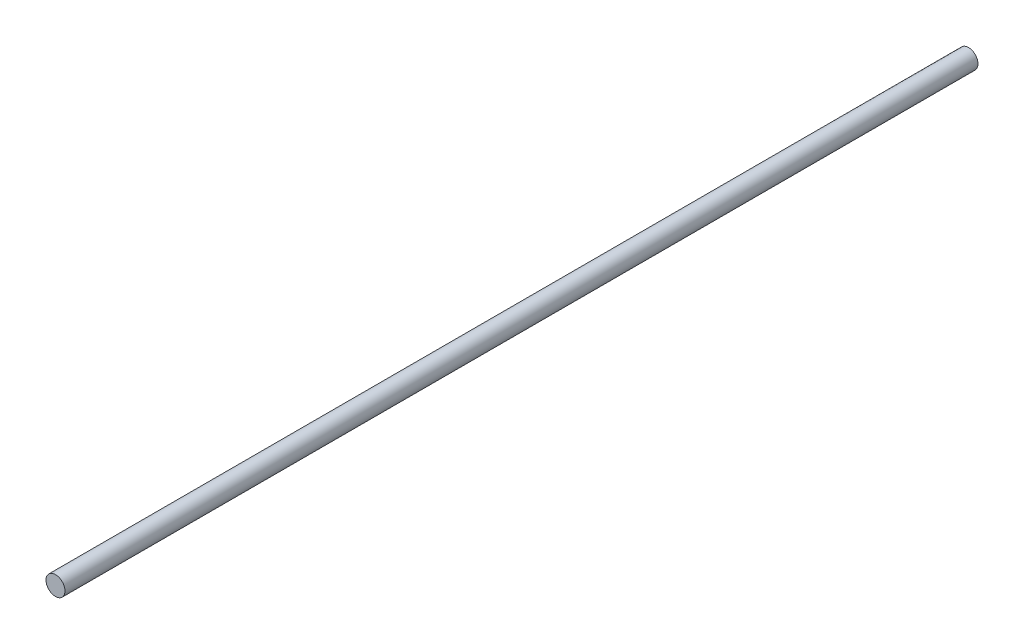
ISO-10303-21;
HEADER;
FILE_DESCRIPTION(('STEP AP214'),'2;1');
FILE_NAME('part.step','',(''),(''),'','','');
FILE_SCHEMA(('AUTOMOTIVE_DESIGN { 1 0 10303 214 1 1 1 1 }'));
ENDSEC;
DATA;
#1=APPLICATION_CONTEXT('core data for automotive mechanical design processes');
#2=APPLICATION_PROTOCOL_DEFINITION('international standard','automotive_design',2000,#1);
#3=PRODUCT_CONTEXT('',#1,'mechanical');
#4=PRODUCT('Part','Part','',(#3));
#5=PRODUCT_RELATED_PRODUCT_CATEGORY('part','',(#4));
#6=PRODUCT_DEFINITION_FORMATION('','',#4);
#7=PRODUCT_DEFINITION_CONTEXT('part definition',#1,'design');
#8=PRODUCT_DEFINITION('design','',#6,#7);
#9=PRODUCT_DEFINITION_SHAPE('','',#8);
#10=(LENGTH_UNIT() NAMED_UNIT(*) SI_UNIT(.MILLI.,.METRE.));
#11=(NAMED_UNIT(*) PLANE_ANGLE_UNIT() SI_UNIT($,.RADIAN.));
#12=(NAMED_UNIT(*) SI_UNIT($,.STERADIAN.) SOLID_ANGLE_UNIT());
#13=UNCERTAINTY_MEASURE_WITH_UNIT(LENGTH_MEASURE(1.E-05),#10,'distance_accuracy_value','');
#14=(GEOMETRIC_REPRESENTATION_CONTEXT(3) GLOBAL_UNCERTAINTY_ASSIGNED_CONTEXT((#13)) GLOBAL_UNIT_ASSIGNED_CONTEXT((#10,
#11,#12)) REPRESENTATION_CONTEXT('',''));
#15=CARTESIAN_POINT('',(0.,0.,0.));
#16=DIRECTION('',(0.,0.,1.));
#17=DIRECTION('',(1.,0.,0.));
#18=AXIS2_PLACEMENT_3D('',#15,#16,#17);
#19=CARTESIAN_POINT('',(0.,0.,384.499667553044));
#20=DIRECTION('',(0.,0.,-1.));
#21=DIRECTION('',(0.,1.,0.));
#22=AXIS2_PLACEMENT_3D('',#19,#20,#21);
#23=CYLINDRICAL_SURFACE('',#22,4.);
#24=CARTESIAN_POINT('',(0.,0.,384.499667553044));
#25=DIRECTION('',(0.,0.,1.));
#26=DIRECTION('',(1.,0.,0.));
#27=AXIS2_PLACEMENT_3D('',#24,#25,#26);
#28=CIRCLE('',#27,4.);
#29=CARTESIAN_POINT('',(4.,0.,384.499667553044));
#30=VERTEX_POINT('',#29);
#31=EDGE_CURVE('E10',#30,#30,#28,.T.);
#32=ORIENTED_EDGE('',*,*,#31,.F.);
#33=EDGE_LOOP('',(#32));
#34=FACE_BOUND('',#33,.T.);
#35=CARTESIAN_POINT('',(0.,0.,0.));
#36=DIRECTION('',(0.,0.,1.));
#37=DIRECTION('',(1.,0.,0.));
#38=AXIS2_PLACEMENT_3D('',#35,#36,#37);
#39=CIRCLE('',#38,4.);
#40=CARTESIAN_POINT('',(4.,0.,0.));
#41=VERTEX_POINT('',#40);
#42=EDGE_CURVE('E34',#41,#41,#39,.T.);
#43=ORIENTED_EDGE('',*,*,#42,.T.);
#44=EDGE_LOOP('',(#43));
#45=FACE_BOUND('',#44,.T.);
#46=ADVANCED_FACE('F31',(#34,#45),#23,.T.);
#47=CARTESIAN_POINT('',(0.,0.,384.499667553044));
#48=DIRECTION('',(0.,0.,1.));
#49=DIRECTION('',(1.,0.,0.));
#50=AXIS2_PLACEMENT_3D('',#47,#48,#49);
#51=PLANE('',#50);
#52=ORIENTED_EDGE('',*,*,#31,.T.);
#53=EDGE_LOOP('',(#52));
#54=FACE_BOUND('',#53,.T.);
#55=ADVANCED_FACE('F46',(#54),#51,.T.);
#56=CARTESIAN_POINT('',(0.,0.,0.));
#57=DIRECTION('',(0.,0.,1.));
#58=DIRECTION('',(1.,0.,0.));
#59=AXIS2_PLACEMENT_3D('',#56,#57,#58);
#60=PLANE('',#59);
#61=ORIENTED_EDGE('',*,*,#42,.F.);
#62=EDGE_LOOP('',(#61));
#63=FACE_BOUND('',#62,.T.);
#64=ADVANCED_FACE('F44',(#63),#60,.F.);
#65=CLOSED_SHELL('',(#46,#55,#64));
#66=MANIFOLD_SOLID_BREP('B2',#65);
#67=ADVANCED_BREP_SHAPE_REPRESENTATION('',(#18,#66),#14);
#68=SHAPE_DEFINITION_REPRESENTATION(#9,#67);
ENDSEC;
END-ISO-10303-21;
